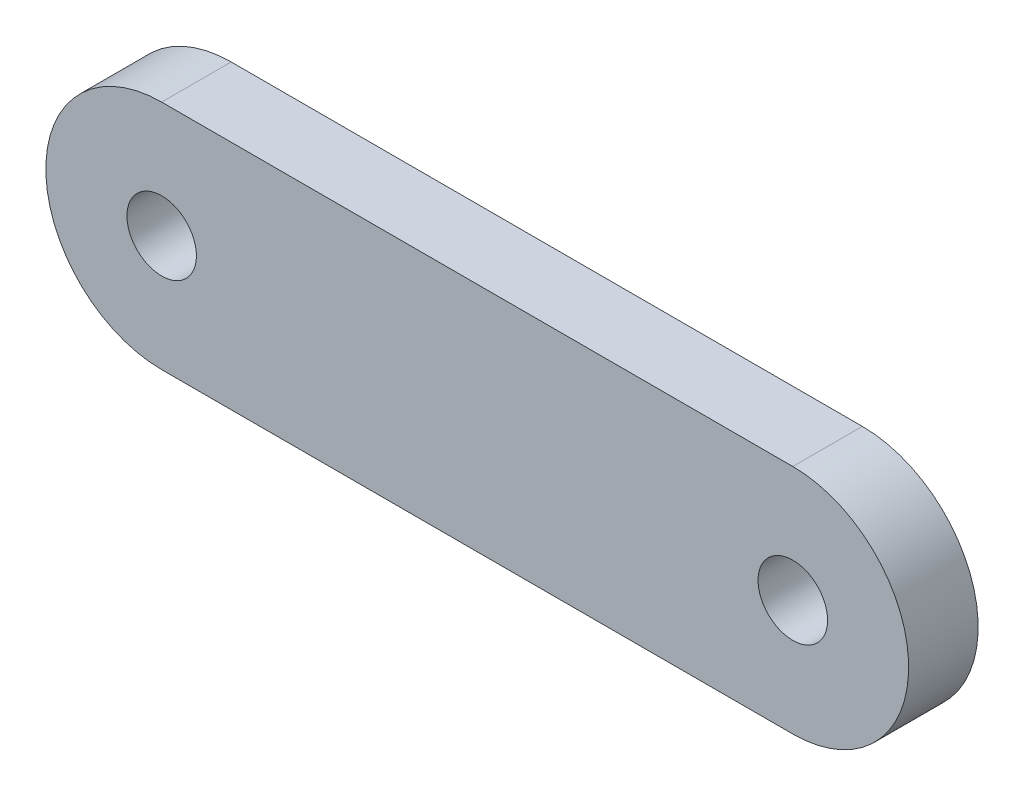
ISO-10303-21;
HEADER;
FILE_DESCRIPTION(('STEP AP214'),'2;1');
FILE_NAME('part.step','',(''),(''),'','','');
FILE_SCHEMA(('AUTOMOTIVE_DESIGN { 1 0 10303 214 1 1 1 1 }'));
ENDSEC;
DATA;
#1=APPLICATION_CONTEXT('core data for automotive mechanical design processes');
#2=APPLICATION_PROTOCOL_DEFINITION('international standard','automotive_design',2000,#1);
#3=PRODUCT_CONTEXT('',#1,'mechanical');
#4=PRODUCT('Part','Part','',(#3));
#5=PRODUCT_RELATED_PRODUCT_CATEGORY('part','',(#4));
#6=PRODUCT_DEFINITION_FORMATION('','',#4);
#7=PRODUCT_DEFINITION_CONTEXT('part definition',#1,'design');
#8=PRODUCT_DEFINITION('design','',#6,#7);
#9=PRODUCT_DEFINITION_SHAPE('','',#8);
#10=(LENGTH_UNIT() NAMED_UNIT(*) SI_UNIT(.MILLI.,.METRE.));
#11=(NAMED_UNIT(*) PLANE_ANGLE_UNIT() SI_UNIT($,.RADIAN.));
#12=(NAMED_UNIT(*) SI_UNIT($,.STERADIAN.) SOLID_ANGLE_UNIT());
#13=UNCERTAINTY_MEASURE_WITH_UNIT(LENGTH_MEASURE(1.E-05),#10,'distance_accuracy_value','');
#14=(GEOMETRIC_REPRESENTATION_CONTEXT(3) GLOBAL_UNCERTAINTY_ASSIGNED_CONTEXT((#13)) GLOBAL_UNIT_ASSIGNED_CONTEXT((#10,
#11,#12)) REPRESENTATION_CONTEXT('',''));
#15=CARTESIAN_POINT('',(0.,0.,0.));
#16=DIRECTION('',(0.,0.,1.));
#17=DIRECTION('',(1.,0.,0.));
#18=AXIS2_PLACEMENT_3D('',#15,#16,#17);
#19=CARTESIAN_POINT('',(-6.81,0.,0.75));
#20=DIRECTION('',(0.,0.,1.));
#21=DIRECTION('',(1.,0.,0.));
#22=AXIS2_PLACEMENT_3D('',#19,#20,#21);
#23=PLANE('',#22);
#24=CARTESIAN_POINT('',(-6.81,0.,0.75));
#25=DIRECTION('',(0.,0.,1.));
#26=DIRECTION('',(1.,0.,0.));
#27=AXIS2_PLACEMENT_3D('',#24,#25,#26);
#28=CIRCLE('',#27,0.750000000000001);
#29=CARTESIAN_POINT('',(-6.06,0.,0.75));
#30=VERTEX_POINT('',#29);
#31=EDGE_CURVE('E100',#30,#30,#28,.T.);
#32=ORIENTED_EDGE('',*,*,#31,.F.);
#33=EDGE_LOOP('',(#32));
#34=FACE_BOUND('',#33,.T.);
#35=CARTESIAN_POINT('',(-6.81,0.,0.75));
#36=DIRECTION('',(0.,0.,1.));
#37=DIRECTION('',(1.,0.,0.));
#38=AXIS2_PLACEMENT_3D('',#35,#36,#37);
#39=CIRCLE('',#38,2.5);
#40=CARTESIAN_POINT('',(-6.81,2.5,0.75));
#41=VERTEX_POINT('',#40);
#42=CARTESIAN_POINT('',(-6.81,-2.5,0.75));
#43=VERTEX_POINT('',#42);
#44=EDGE_CURVE('E85',#41,#43,#39,.T.);
#45=ORIENTED_EDGE('',*,*,#44,.T.);
#46=DIRECTION('',(1.,0.,0.));
#47=VECTOR('',#46,1.);
#48=CARTESIAN_POINT('',(-6.81,-2.5,0.75));
#49=LINE('',#48,#47);
#50=CARTESIAN_POINT('',(6.81,-2.5,0.75));
#51=VERTEX_POINT('',#50);
#52=EDGE_CURVE('E80',#43,#51,#49,.T.);
#53=ORIENTED_EDGE('',*,*,#52,.T.);
#54=CARTESIAN_POINT('',(6.81,0.,0.75));
#55=DIRECTION('',(0.,0.,1.));
#56=DIRECTION('',(1.,0.,0.));
#57=AXIS2_PLACEMENT_3D('',#54,#55,#56);
#58=CIRCLE('',#57,2.5);
#59=CARTESIAN_POINT('',(6.81,2.50000000000001,0.75));
#60=VERTEX_POINT('',#59);
#61=EDGE_CURVE('E83',#51,#60,#58,.T.);
#62=ORIENTED_EDGE('',*,*,#61,.T.);
#63=DIRECTION('',(-1.,0.,0.));
#64=VECTOR('',#63,1.);
#65=CARTESIAN_POINT('',(-6.81,2.5,0.75));
#66=LINE('',#65,#64);
#67=EDGE_CURVE('E50',#60,#41,#66,.T.);
#68=ORIENTED_EDGE('',*,*,#67,.T.);
#69=EDGE_LOOP('',(#45,#53,#62,#68));
#70=FACE_BOUND('',#69,.T.);
#71=CARTESIAN_POINT('',(6.81,0.,0.75));
#72=DIRECTION('',(0.,0.,1.));
#73=DIRECTION('',(1.,0.,0.));
#74=AXIS2_PLACEMENT_3D('',#71,#72,#73);
#75=CIRCLE('',#74,0.750000000000001);
#76=CARTESIAN_POINT('',(7.56,0.,0.75));
#77=VERTEX_POINT('',#76);
#78=EDGE_CURVE('E115',#77,#77,#75,.T.);
#79=ORIENTED_EDGE('',*,*,#78,.F.);
#80=EDGE_LOOP('',(#79));
#81=FACE_BOUND('',#80,.T.);
#82=ADVANCED_FACE('F33',(#34,#70,#81),#23,.T.);
#83=CARTESIAN_POINT('',(-6.81,0.,-0.75));
#84=DIRECTION('',(0.,0.,1.));
#85=DIRECTION('',(1.,0.,0.));
#86=AXIS2_PLACEMENT_3D('',#83,#84,#85);
#87=PLANE('',#86);
#88=CARTESIAN_POINT('',(-6.81,0.,-0.75));
#89=DIRECTION('',(0.,0.,1.));
#90=DIRECTION('',(1.,0.,0.));
#91=AXIS2_PLACEMENT_3D('',#88,#89,#90);
#92=CIRCLE('',#91,2.5);
#93=CARTESIAN_POINT('',(-6.81,2.5,-0.75));
#94=VERTEX_POINT('',#93);
#95=CARTESIAN_POINT('',(-6.81,-2.5,-0.75));
#96=VERTEX_POINT('',#95);
#97=EDGE_CURVE('E97',#94,#96,#92,.T.);
#98=ORIENTED_EDGE('',*,*,#97,.F.);
#99=DIRECTION('',(-1.,0.,0.));
#100=VECTOR('',#99,1.);
#101=CARTESIAN_POINT('',(-6.81,2.5,-0.75));
#102=LINE('',#101,#100);
#103=CARTESIAN_POINT('',(6.81,2.50000000000001,-0.75));
#104=VERTEX_POINT('',#103);
#105=EDGE_CURVE('E73',#104,#94,#102,.T.);
#106=ORIENTED_EDGE('',*,*,#105,.F.);
#107=CARTESIAN_POINT('',(6.81,0.,-0.75));
#108=DIRECTION('',(0.,0.,1.));
#109=DIRECTION('',(1.,0.,0.));
#110=AXIS2_PLACEMENT_3D('',#107,#108,#109);
#111=CIRCLE('',#110,2.5);
#112=CARTESIAN_POINT('',(6.81,-2.5,-0.75));
#113=VERTEX_POINT('',#112);
#114=EDGE_CURVE('E67',#113,#104,#111,.T.);
#115=ORIENTED_EDGE('',*,*,#114,.F.);
#116=DIRECTION('',(1.,0.,0.));
#117=VECTOR('',#116,1.);
#118=CARTESIAN_POINT('',(-6.81,-2.5,-0.75));
#119=LINE('',#118,#117);
#120=EDGE_CURVE('E89',#96,#113,#119,.T.);
#121=ORIENTED_EDGE('',*,*,#120,.F.);
#122=EDGE_LOOP('',(#98,#106,#115,#121));
#123=FACE_BOUND('',#122,.T.);
#124=CARTESIAN_POINT('',(-6.81,0.,-0.75));
#125=DIRECTION('',(0.,0.,1.));
#126=DIRECTION('',(1.,0.,0.));
#127=AXIS2_PLACEMENT_3D('',#124,#125,#126);
#128=CIRCLE('',#127,0.750000000000001);
#129=CARTESIAN_POINT('',(-6.06,0.,-0.75));
#130=VERTEX_POINT('',#129);
#131=EDGE_CURVE('E112',#130,#130,#128,.T.);
#132=ORIENTED_EDGE('',*,*,#131,.T.);
#133=EDGE_LOOP('',(#132));
#134=FACE_BOUND('',#133,.T.);
#135=CARTESIAN_POINT('',(6.81,0.,-0.75));
#136=DIRECTION('',(0.,0.,1.));
#137=DIRECTION('',(1.,0.,0.));
#138=AXIS2_PLACEMENT_3D('',#135,#136,#137);
#139=CIRCLE('',#138,0.750000000000001);
#140=CARTESIAN_POINT('',(7.56,0.,-0.75));
#141=VERTEX_POINT('',#140);
#142=EDGE_CURVE('E118',#141,#141,#139,.T.);
#143=ORIENTED_EDGE('',*,*,#142,.T.);
#144=EDGE_LOOP('',(#143));
#145=FACE_BOUND('',#144,.T.);
#146=ADVANCED_FACE('F108',(#123,#134,#145),#87,.F.);
#147=CARTESIAN_POINT('',(-6.81,0.,0.75));
#148=DIRECTION('',(0.,0.,-1.));
#149=DIRECTION('',(-1.,0.,0.));
#150=AXIS2_PLACEMENT_3D('',#147,#148,#149);
#151=CYLINDRICAL_SURFACE('',#150,2.5);
#152=ORIENTED_EDGE('',*,*,#97,.T.);
#153=DIRECTION('',(0.,0.,-1.));
#154=VECTOR('',#153,1.);
#155=CARTESIAN_POINT('',(-6.81,-2.5,0.75));
#156=LINE('',#155,#154);
#157=EDGE_CURVE('E11',#43,#96,#156,.T.);
#158=ORIENTED_EDGE('',*,*,#157,.F.);
#159=ORIENTED_EDGE('',*,*,#44,.F.);
#160=DIRECTION('',(0.,0.,-1.));
#161=VECTOR('',#160,1.);
#162=CARTESIAN_POINT('',(-6.81,2.5,0.75));
#163=LINE('',#162,#161);
#164=EDGE_CURVE('E93',#41,#94,#163,.T.);
#165=ORIENTED_EDGE('',*,*,#164,.T.);
#166=EDGE_LOOP('',(#152,#158,#159,#165));
#167=FACE_BOUND('',#166,.T.);
#168=ADVANCED_FACE('F35',(#167),#151,.T.);
#169=CARTESIAN_POINT('',(-6.81,-2.5,0.75));
#170=DIRECTION('',(0.,1.,0.));
#171=DIRECTION('',(-1.,0.,0.));
#172=AXIS2_PLACEMENT_3D('',#169,#170,#171);
#173=PLANE('',#172);
#174=ORIENTED_EDGE('',*,*,#120,.T.);
#175=DIRECTION('',(0.,0.,-1.));
#176=VECTOR('',#175,1.);
#177=CARTESIAN_POINT('',(6.81,-2.5,0.75));
#178=LINE('',#177,#176);
#179=EDGE_CURVE('E42',#51,#113,#178,.T.);
#180=ORIENTED_EDGE('',*,*,#179,.F.);
#181=ORIENTED_EDGE('',*,*,#52,.F.);
#182=ORIENTED_EDGE('',*,*,#157,.T.);
#183=EDGE_LOOP('',(#174,#180,#181,#182));
#184=FACE_BOUND('',#183,.T.);
#185=ADVANCED_FACE('F88',(#184),#173,.F.);
#186=CARTESIAN_POINT('',(6.81,0.,0.75));
#187=DIRECTION('',(0.,0.,-1.));
#188=DIRECTION('',(-1.,0.,0.));
#189=AXIS2_PLACEMENT_3D('',#186,#187,#188);
#190=CYLINDRICAL_SURFACE('',#189,2.5);
#191=ORIENTED_EDGE('',*,*,#114,.T.);
#192=DIRECTION('',(0.,0.,-1.));
#193=VECTOR('',#192,1.);
#194=CARTESIAN_POINT('',(6.81,2.50000000000001,0.75));
#195=LINE('',#194,#193);
#196=EDGE_CURVE('E90',#60,#104,#195,.T.);
#197=ORIENTED_EDGE('',*,*,#196,.F.);
#198=ORIENTED_EDGE('',*,*,#61,.F.);
#199=ORIENTED_EDGE('',*,*,#179,.T.);
#200=EDGE_LOOP('',(#191,#197,#198,#199));
#201=FACE_BOUND('',#200,.T.);
#202=ADVANCED_FACE('F91',(#201),#190,.T.);
#203=CARTESIAN_POINT('',(-6.81,2.5,0.75));
#204=DIRECTION('',(0.,-1.,0.));
#205=DIRECTION('',(1.,0.,0.));
#206=AXIS2_PLACEMENT_3D('',#203,#204,#205);
#207=PLANE('',#206);
#208=ORIENTED_EDGE('',*,*,#105,.T.);
#209=ORIENTED_EDGE('',*,*,#164,.F.);
#210=ORIENTED_EDGE('',*,*,#67,.F.);
#211=ORIENTED_EDGE('',*,*,#196,.T.);
#212=EDGE_LOOP('',(#208,#209,#210,#211));
#213=FACE_BOUND('',#212,.T.);
#214=ADVANCED_FACE('F105',(#213),#207,.F.);
#215=CARTESIAN_POINT('',(-6.81,0.,0.75));
#216=DIRECTION('',(0.,0.,-1.));
#217=DIRECTION('',(-1.,0.,0.));
#218=AXIS2_PLACEMENT_3D('',#215,#216,#217);
#219=CYLINDRICAL_SURFACE('',#218,0.750000000000001);
#220=ORIENTED_EDGE('',*,*,#31,.T.);
#221=EDGE_LOOP('',(#220));
#222=FACE_BOUND('',#221,.T.);
#223=ORIENTED_EDGE('',*,*,#131,.F.);
#224=EDGE_LOOP('',(#223));
#225=FACE_BOUND('',#224,.T.);
#226=ADVANCED_FACE('F135',(#222,#225),#219,.F.);
#227=CARTESIAN_POINT('',(6.81,0.,0.75));
#228=DIRECTION('',(0.,0.,-1.));
#229=DIRECTION('',(-1.,0.,0.));
#230=AXIS2_PLACEMENT_3D('',#227,#228,#229);
#231=CYLINDRICAL_SURFACE('',#230,0.750000000000001);
#232=ORIENTED_EDGE('',*,*,#78,.T.);
#233=EDGE_LOOP('',(#232));
#234=FACE_BOUND('',#233,.T.);
#235=ORIENTED_EDGE('',*,*,#142,.F.);
#236=EDGE_LOOP('',(#235));
#237=FACE_BOUND('',#236,.T.);
#238=ADVANCED_FACE('F124',(#234,#237),#231,.F.);
#239=CLOSED_SHELL('',(#82,#146,#168,#185,#202,#214,#226,#238));
#240=MANIFOLD_SOLID_BREP('B2',#239);
#241=ADVANCED_BREP_SHAPE_REPRESENTATION('',(#18,#240),#14);
#242=SHAPE_DEFINITION_REPRESENTATION(#9,#241);
ENDSEC;
END-ISO-10303-21;
